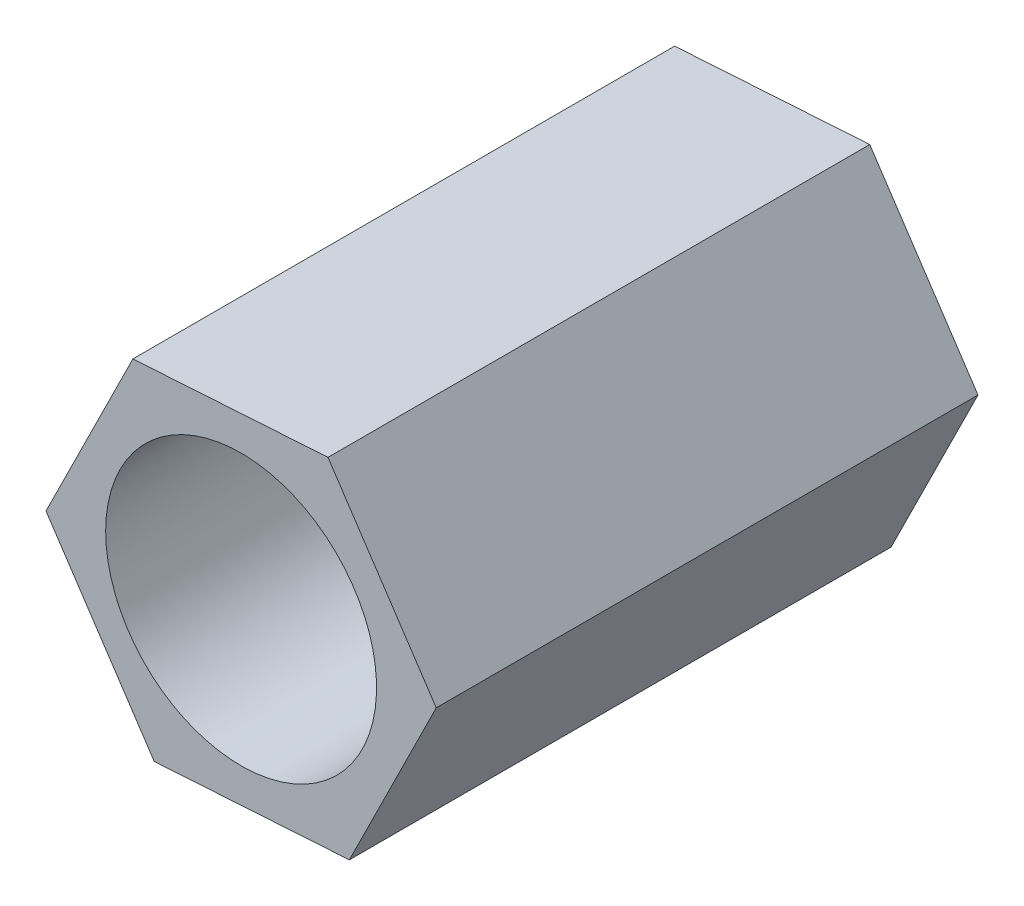
ISO-10303-21;
HEADER;
FILE_DESCRIPTION(('STEP AP214'),'2;1');
FILE_NAME('part.step','',(''),(''),'','','');
FILE_SCHEMA(('AUTOMOTIVE_DESIGN { 1 0 10303 214 1 1 1 1 }'));
ENDSEC;
DATA;
#1=APPLICATION_CONTEXT('core data for automotive mechanical design processes');
#2=APPLICATION_PROTOCOL_DEFINITION('international standard','automotive_design',2000,#1);
#3=PRODUCT_CONTEXT('',#1,'mechanical');
#4=PRODUCT('Part','Part','',(#3));
#5=PRODUCT_RELATED_PRODUCT_CATEGORY('part','',(#4));
#6=PRODUCT_DEFINITION_FORMATION('','',#4);
#7=PRODUCT_DEFINITION_CONTEXT('part definition',#1,'design');
#8=PRODUCT_DEFINITION('design','',#6,#7);
#9=PRODUCT_DEFINITION_SHAPE('','',#8);
#10=(LENGTH_UNIT() NAMED_UNIT(*) SI_UNIT(.MILLI.,.METRE.));
#11=(NAMED_UNIT(*) PLANE_ANGLE_UNIT() SI_UNIT($,.RADIAN.));
#12=(NAMED_UNIT(*) SI_UNIT($,.STERADIAN.) SOLID_ANGLE_UNIT());
#13=UNCERTAINTY_MEASURE_WITH_UNIT(LENGTH_MEASURE(1.E-05),#10,'distance_accuracy_value','');
#14=(GEOMETRIC_REPRESENTATION_CONTEXT(3) GLOBAL_UNCERTAINTY_ASSIGNED_CONTEXT((#13)) GLOBAL_UNIT_ASSIGNED_CONTEXT((#10,
#11,#12)) REPRESENTATION_CONTEXT('',''));
#15=CARTESIAN_POINT('',(0.,0.,0.));
#16=DIRECTION('',(0.,0.,1.));
#17=DIRECTION('',(1.,0.,0.));
#18=AXIS2_PLACEMENT_3D('',#15,#16,#17);
#19=CARTESIAN_POINT('',(2.88100525038189,0.182049665216225,8.));
#20=DIRECTION('',(-0.832769648149025,-0.55361964661828,0.));
#21=DIRECTION('',(0.55361964661828,-0.832769648149025,0.));
#22=AXIS2_PLACEMENT_3D('',#19,#20,#21);
#23=PLANE('',#22);
#24=DIRECTION('',(-0.55361964661828,0.832769648149025,0.));
#25=VECTOR('',#24,1.);
#26=CARTESIAN_POINT('',(2.88100525038189,0.182049665216225,0.));
#27=LINE('',#26,#25);
#28=CARTESIAN_POINT('',(2.88100525038189,0.182049665216225,0.));
#29=VERTEX_POINT('',#28);
#30=CARTESIAN_POINT('',(1.28284299036324,2.58604856787517,0.));
#31=VERTEX_POINT('',#30);
#32=EDGE_CURVE('E128',#29,#31,#27,.T.);
#33=ORIENTED_EDGE('',*,*,#32,.T.);
#34=DIRECTION('',(0.,0.,-1.));
#35=VECTOR('',#34,1.);
#36=CARTESIAN_POINT('',(1.28284299036324,2.58604856787517,8.));
#37=LINE('',#36,#35);
#38=CARTESIAN_POINT('',(1.28284299036324,2.58604856787517,8.));
#39=VERTEX_POINT('',#38);
#40=EDGE_CURVE('E11',#39,#31,#37,.T.);
#41=ORIENTED_EDGE('',*,*,#40,.F.);
#42=DIRECTION('',(-0.55361964661828,0.832769648149025,0.));
#43=VECTOR('',#42,1.);
#44=CARTESIAN_POINT('',(2.88100525038189,0.182049665216225,8.));
#45=LINE('',#44,#43);
#46=CARTESIAN_POINT('',(2.88100525038189,0.182049665216225,8.));
#47=VERTEX_POINT('',#46);
#48=EDGE_CURVE('E145',#47,#39,#45,.T.);
#49=ORIENTED_EDGE('',*,*,#48,.F.);
#50=DIRECTION('',(0.,0.,-1.));
#51=VECTOR('',#50,1.);
#52=CARTESIAN_POINT('',(2.88100525038189,0.182049665216225,8.));
#53=LINE('',#52,#51);
#54=EDGE_CURVE('E124',#47,#29,#53,.T.);
#55=ORIENTED_EDGE('',*,*,#54,.T.);
#56=EDGE_LOOP('',(#33,#41,#49,#55));
#57=FACE_BOUND('',#56,.T.);
#58=ADVANCED_FACE('F39',(#57),#23,.F.);
#59=CARTESIAN_POINT('',(1.28284299036324,2.58604856787517,8.));
#60=DIRECTION('',(0.0630638539310811,-0.998009494106824,0.));
#61=DIRECTION('',(0.998009494106824,0.0630638539310811,0.));
#62=AXIS2_PLACEMENT_3D('',#59,#60,#61);
#63=PLANE('',#62);
#64=DIRECTION('',(-0.998009494106824,-0.0630638539310811,0.));
#65=VECTOR('',#64,1.);
#66=CARTESIAN_POINT('',(1.28284299036324,2.58604856787517,0.));
#67=LINE('',#66,#65);
#68=CARTESIAN_POINT('',(-1.59816226001865,2.40399890265895,0.));
#69=VERTEX_POINT('',#68);
#70=EDGE_CURVE('E132',#31,#69,#67,.T.);
#71=ORIENTED_EDGE('',*,*,#70,.T.);
#72=DIRECTION('',(0.,0.,-1.));
#73=VECTOR('',#72,1.);
#74=CARTESIAN_POINT('',(-1.59816226001865,2.40399890265895,8.));
#75=LINE('',#74,#73);
#76=CARTESIAN_POINT('',(-1.59816226001865,2.40399890265895,8.));
#77=VERTEX_POINT('',#76);
#78=EDGE_CURVE('E48',#77,#69,#75,.T.);
#79=ORIENTED_EDGE('',*,*,#78,.F.);
#80=DIRECTION('',(-0.998009494106824,-0.0630638539310811,0.));
#81=VECTOR('',#80,1.);
#82=CARTESIAN_POINT('',(1.28284299036324,2.58604856787517,8.));
#83=LINE('',#82,#81);
#84=EDGE_CURVE('E93',#39,#77,#83,.T.);
#85=ORIENTED_EDGE('',*,*,#84,.F.);
#86=ORIENTED_EDGE('',*,*,#40,.T.);
#87=EDGE_LOOP('',(#71,#79,#85,#86));
#88=FACE_BOUND('',#87,.T.);
#89=ADVANCED_FACE('F174',(#88),#63,.F.);
#90=CARTESIAN_POINT('',(-1.59816226001865,2.40399890265895,8.));
#91=DIRECTION('',(0.895833502080107,-0.444389847488544,0.));
#92=DIRECTION('',(0.444389847488544,0.895833502080107,0.));
#93=AXIS2_PLACEMENT_3D('',#90,#91,#92);
#94=PLANE('',#93);
#95=DIRECTION('',(-0.444389847488544,-0.895833502080107,0.));
#96=VECTOR('',#95,1.);
#97=CARTESIAN_POINT('',(-1.59816226001865,2.40399890265895,0.));
#98=LINE('',#97,#96);
#99=CARTESIAN_POINT('',(-2.88100525038189,-0.182049665216226,0.));
#100=VERTEX_POINT('',#99);
#101=EDGE_CURVE('E136',#69,#100,#98,.T.);
#102=ORIENTED_EDGE('',*,*,#101,.T.);
#103=DIRECTION('',(0.,0.,-1.));
#104=VECTOR('',#103,1.);
#105=CARTESIAN_POINT('',(-2.88100525038189,-0.182049665216226,8.));
#106=LINE('',#105,#104);
#107=CARTESIAN_POINT('',(-2.88100525038189,-0.182049665216226,8.));
#108=VERTEX_POINT('',#107);
#109=EDGE_CURVE('E117',#108,#100,#106,.T.);
#110=ORIENTED_EDGE('',*,*,#109,.F.);
#111=DIRECTION('',(-0.444389847488544,-0.895833502080107,0.));
#112=VECTOR('',#111,1.);
#113=CARTESIAN_POINT('',(-1.59816226001865,2.40399890265895,8.));
#114=LINE('',#113,#112);
#115=EDGE_CURVE('E106',#77,#108,#114,.T.);
#116=ORIENTED_EDGE('',*,*,#115,.F.);
#117=ORIENTED_EDGE('',*,*,#78,.T.);
#118=EDGE_LOOP('',(#102,#110,#116,#117));
#119=FACE_BOUND('',#118,.T.);
#120=ADVANCED_FACE('F155',(#119),#94,.F.);
#121=CARTESIAN_POINT('',(-2.88100525038189,-0.182049665216226,8.));
#122=DIRECTION('',(0.832769648149025,0.55361964661828,0.));
#123=DIRECTION('',(-0.55361964661828,0.832769648149025,0.));
#124=AXIS2_PLACEMENT_3D('',#121,#122,#123);
#125=PLANE('',#124);
#126=DIRECTION('',(0.55361964661828,-0.832769648149025,0.));
#127=VECTOR('',#126,1.);
#128=CARTESIAN_POINT('',(-2.88100525038189,-0.182049665216226,0.));
#129=LINE('',#128,#127);
#130=CARTESIAN_POINT('',(-1.28284299036324,-2.58604856787517,0.));
#131=VERTEX_POINT('',#130);
#132=EDGE_CURVE('E115',#100,#131,#129,.T.);
#133=ORIENTED_EDGE('',*,*,#132,.T.);
#134=DIRECTION('',(0.,0.,-1.));
#135=VECTOR('',#134,1.);
#136=CARTESIAN_POINT('',(-1.28284299036324,-2.58604856787517,8.));
#137=LINE('',#136,#135);
#138=CARTESIAN_POINT('',(-1.28284299036324,-2.58604856787517,8.));
#139=VERTEX_POINT('',#138);
#140=EDGE_CURVE('E112',#139,#131,#137,.T.);
#141=ORIENTED_EDGE('',*,*,#140,.F.);
#142=DIRECTION('',(0.55361964661828,-0.832769648149025,0.));
#143=VECTOR('',#142,1.);
#144=CARTESIAN_POINT('',(-2.88100525038189,-0.182049665216226,8.));
#145=LINE('',#144,#143);
#146=EDGE_CURVE('E100',#108,#139,#145,.T.);
#147=ORIENTED_EDGE('',*,*,#146,.F.);
#148=ORIENTED_EDGE('',*,*,#109,.T.);
#149=EDGE_LOOP('',(#133,#141,#147,#148));
#150=FACE_BOUND('',#149,.T.);
#151=ADVANCED_FACE('F113',(#150),#125,.F.);
#152=CARTESIAN_POINT('',(-1.28284299036324,-2.58604856787517,8.));
#153=DIRECTION('',(-0.0630638539310813,0.998009494106824,0.));
#154=DIRECTION('',(-0.998009494106824,-0.0630638539310813,0.));
#155=AXIS2_PLACEMENT_3D('',#152,#153,#154);
#156=PLANE('',#155);
#157=DIRECTION('',(0.998009494106824,0.0630638539310813,0.));
#158=VECTOR('',#157,1.);
#159=CARTESIAN_POINT('',(-1.28284299036324,-2.58604856787517,0.));
#160=LINE('',#159,#158);
#161=CARTESIAN_POINT('',(1.59816226001865,-2.40399890265895,0.));
#162=VERTEX_POINT('',#161);
#163=EDGE_CURVE('E79',#131,#162,#160,.T.);
#164=ORIENTED_EDGE('',*,*,#163,.T.);
#165=DIRECTION('',(0.,0.,-1.));
#166=VECTOR('',#165,1.);
#167=CARTESIAN_POINT('',(1.59816226001865,-2.40399890265895,8.));
#168=LINE('',#167,#166);
#169=CARTESIAN_POINT('',(1.59816226001865,-2.40399890265895,8.));
#170=VERTEX_POINT('',#169);
#171=EDGE_CURVE('E118',#170,#162,#168,.T.);
#172=ORIENTED_EDGE('',*,*,#171,.F.);
#173=DIRECTION('',(0.998009494106824,0.0630638539310813,0.));
#174=VECTOR('',#173,1.);
#175=CARTESIAN_POINT('',(-1.28284299036324,-2.58604856787517,8.));
#176=LINE('',#175,#174);
#177=EDGE_CURVE('E104',#139,#170,#176,.T.);
#178=ORIENTED_EDGE('',*,*,#177,.F.);
#179=ORIENTED_EDGE('',*,*,#140,.T.);
#180=EDGE_LOOP('',(#164,#172,#178,#179));
#181=FACE_BOUND('',#180,.T.);
#182=ADVANCED_FACE('F120',(#181),#156,.F.);
#183=CARTESIAN_POINT('',(1.59816226001865,-2.40399890265895,8.));
#184=DIRECTION('',(-0.895833502080106,0.444389847488544,0.));
#185=DIRECTION('',(-0.444389847488544,-0.895833502080106,0.));
#186=AXIS2_PLACEMENT_3D('',#183,#184,#185);
#187=PLANE('',#186);
#188=DIRECTION('',(0.444389847488544,0.895833502080106,0.));
#189=VECTOR('',#188,1.);
#190=CARTESIAN_POINT('',(1.59816226001865,-2.40399890265895,0.));
#191=LINE('',#190,#189);
#192=EDGE_CURVE('E85',#162,#29,#191,.T.);
#193=ORIENTED_EDGE('',*,*,#192,.T.);
#194=ORIENTED_EDGE('',*,*,#54,.F.);
#195=DIRECTION('',(0.444389847488544,0.895833502080106,0.));
#196=VECTOR('',#195,1.);
#197=CARTESIAN_POINT('',(1.59816226001865,-2.40399890265895,8.));
#198=LINE('',#197,#196);
#199=EDGE_CURVE('E56',#170,#47,#198,.T.);
#200=ORIENTED_EDGE('',*,*,#199,.F.);
#201=ORIENTED_EDGE('',*,*,#171,.T.);
#202=EDGE_LOOP('',(#193,#194,#200,#201));
#203=FACE_BOUND('',#202,.T.);
#204=ADVANCED_FACE('F162',(#203),#187,.F.);
#205=CARTESIAN_POINT('',(0.,0.,8.));
#206=DIRECTION('',(0.,0.,1.));
#207=DIRECTION('',(1.,0.,0.));
#208=AXIS2_PLACEMENT_3D('',#205,#206,#207);
#209=PLANE('',#208);
#210=CARTESIAN_POINT('',(0.,0.,8.));
#211=DIRECTION('',(0.,0.,-1.));
#212=DIRECTION('',(-1.,0.,0.));
#213=AXIS2_PLACEMENT_3D('',#210,#211,#212);
#214=CIRCLE('',#213,2.);
#215=CARTESIAN_POINT('',(-2.,0.,8.));
#216=VERTEX_POINT('',#215);
#217=EDGE_CURVE('E133',#216,#216,#214,.T.);
#218=ORIENTED_EDGE('',*,*,#217,.T.);
#219=EDGE_LOOP('',(#218));
#220=FACE_BOUND('',#219,.T.);
#221=ORIENTED_EDGE('',*,*,#48,.T.);
#222=ORIENTED_EDGE('',*,*,#84,.T.);
#223=ORIENTED_EDGE('',*,*,#115,.T.);
#224=ORIENTED_EDGE('',*,*,#146,.T.);
#225=ORIENTED_EDGE('',*,*,#177,.T.);
#226=ORIENTED_EDGE('',*,*,#199,.T.);
#227=EDGE_LOOP('',(#221,#222,#223,#224,#225,#226));
#228=FACE_BOUND('',#227,.T.);
#229=ADVANCED_FACE('F102',(#220,#228),#209,.T.);
#230=CARTESIAN_POINT('',(0.,0.,0.));
#231=DIRECTION('',(0.,0.,1.));
#232=DIRECTION('',(1.,0.,0.));
#233=AXIS2_PLACEMENT_3D('',#230,#231,#232);
#234=PLANE('',#233);
#235=CARTESIAN_POINT('',(0.,0.,0.));
#236=DIRECTION('',(0.,0.,-1.));
#237=DIRECTION('',(-1.,0.,0.));
#238=AXIS2_PLACEMENT_3D('',#235,#236,#237);
#239=CIRCLE('',#238,2.);
#240=CARTESIAN_POINT('',(-2.,0.,0.));
#241=VERTEX_POINT('',#240);
#242=EDGE_CURVE('E229',#241,#241,#239,.T.);
#243=ORIENTED_EDGE('',*,*,#242,.F.);
#244=EDGE_LOOP('',(#243));
#245=FACE_BOUND('',#244,.T.);
#246=ORIENTED_EDGE('',*,*,#32,.F.);
#247=ORIENTED_EDGE('',*,*,#192,.F.);
#248=ORIENTED_EDGE('',*,*,#163,.F.);
#249=ORIENTED_EDGE('',*,*,#132,.F.);
#250=ORIENTED_EDGE('',*,*,#101,.F.);
#251=ORIENTED_EDGE('',*,*,#70,.F.);
#252=EDGE_LOOP('',(#246,#247,#248,#249,#250,#251));
#253=FACE_BOUND('',#252,.T.);
#254=ADVANCED_FACE('F158',(#245,#253),#234,.F.);
#255=CARTESIAN_POINT('',(0.,0.,8.));
#256=DIRECTION('',(0.,0.,-1.));
#257=DIRECTION('',(-1.,0.,0.));
#258=AXIS2_PLACEMENT_3D('',#255,#256,#257);
#259=CYLINDRICAL_SURFACE('',#258,2.);
#260=ORIENTED_EDGE('',*,*,#217,.F.);
#261=EDGE_LOOP('',(#260));
#262=FACE_BOUND('',#261,.T.);
#263=ORIENTED_EDGE('',*,*,#242,.T.);
#264=EDGE_LOOP('',(#263));
#265=FACE_BOUND('',#264,.T.);
#266=ADVANCED_FACE('F211',(#262,#265),#259,.F.);
#267=CLOSED_SHELL('',(#58,#89,#120,#151,#182,#204,#229,#254,#266));
#268=MANIFOLD_SOLID_BREP('B2',#267);
#269=ADVANCED_BREP_SHAPE_REPRESENTATION('',(#18,#268),#14);
#270=SHAPE_DEFINITION_REPRESENTATION(#9,#269);
ENDSEC;
END-ISO-10303-21;
